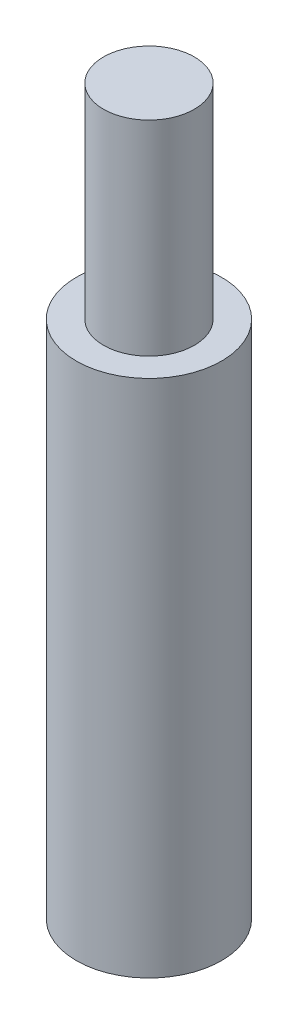
ISO-10303-21;
HEADER;
FILE_DESCRIPTION(('STEP AP214'),'2;1');
FILE_NAME('part.step','',(''),(''),'','','');
FILE_SCHEMA(('AUTOMOTIVE_DESIGN { 1 0 10303 214 1 1 1 1 }'));
ENDSEC;
DATA;
#1=APPLICATION_CONTEXT('core data for automotive mechanical design processes');
#2=APPLICATION_PROTOCOL_DEFINITION('international standard','automotive_design',2000,#1);
#3=PRODUCT_CONTEXT('',#1,'mechanical');
#4=PRODUCT('Part','Part','',(#3));
#5=PRODUCT_RELATED_PRODUCT_CATEGORY('part','',(#4));
#6=PRODUCT_DEFINITION_FORMATION('','',#4);
#7=PRODUCT_DEFINITION_CONTEXT('part definition',#1,'design');
#8=PRODUCT_DEFINITION('design','',#6,#7);
#9=PRODUCT_DEFINITION_SHAPE('','',#8);
#10=(LENGTH_UNIT() NAMED_UNIT(*) SI_UNIT(.MILLI.,.METRE.));
#11=(NAMED_UNIT(*) PLANE_ANGLE_UNIT() SI_UNIT($,.RADIAN.));
#12=(NAMED_UNIT(*) SI_UNIT($,.STERADIAN.) SOLID_ANGLE_UNIT());
#13=UNCERTAINTY_MEASURE_WITH_UNIT(LENGTH_MEASURE(1.E-05),#10,'distance_accuracy_value','');
#14=(GEOMETRIC_REPRESENTATION_CONTEXT(3) GLOBAL_UNCERTAINTY_ASSIGNED_CONTEXT((#13)) GLOBAL_UNIT_ASSIGNED_CONTEXT((#10,
#11,#12)) REPRESENTATION_CONTEXT('',''));
#15=CARTESIAN_POINT('',(0.,0.,0.));
#16=DIRECTION('',(0.,0.,1.));
#17=DIRECTION('',(1.,0.,0.));
#18=AXIS2_PLACEMENT_3D('',#15,#16,#17);
#19=CARTESIAN_POINT('',(0.,50.620000106,0.));
#20=DIRECTION('',(0.,-1.,0.));
#21=DIRECTION('',(0.,0.,-1.));
#22=AXIS2_PLACEMENT_3D('',#19,#20,#21);
#23=CYLINDRICAL_SURFACE('',#22,5.08);
#24=CARTESIAN_POINT('',(0.,0.,0.));
#25=DIRECTION('',(0.,1.,0.));
#26=DIRECTION('',(0.,0.,1.));
#27=AXIS2_PLACEMENT_3D('',#24,#25,#26);
#28=CIRCLE('',#27,5.08);
#29=CARTESIAN_POINT('',(0.,0.,5.08));
#30=VERTEX_POINT('',#29);
#31=EDGE_CURVE('E10',#30,#30,#28,.T.);
#32=ORIENTED_EDGE('',*,*,#31,.T.);
#33=EDGE_LOOP('',(#32));
#34=FACE_BOUND('',#33,.T.);
#35=CARTESIAN_POINT('',(0.,36.320000106,0.));
#36=DIRECTION('',(0.,1.,0.));
#37=DIRECTION('',(0.,0.,1.));
#38=AXIS2_PLACEMENT_3D('',#35,#36,#37);
#39=CIRCLE('',#38,5.08);
#40=CARTESIAN_POINT('',(0.,36.320000106,5.08));
#41=VERTEX_POINT('',#40);
#42=EDGE_CURVE('E37',#41,#41,#39,.T.);
#43=ORIENTED_EDGE('',*,*,#42,.F.);
#44=EDGE_LOOP('',(#43));
#45=FACE_BOUND('',#44,.T.);
#46=ADVANCED_FACE('F31',(#34,#45),#23,.T.);
#47=CARTESIAN_POINT('',(0.,0.,0.));
#48=DIRECTION('',(0.,1.,0.));
#49=DIRECTION('',(0.,0.,1.));
#50=AXIS2_PLACEMENT_3D('',#47,#48,#49);
#51=PLANE('',#50);
#52=ORIENTED_EDGE('',*,*,#31,.F.);
#53=EDGE_LOOP('',(#52));
#54=FACE_BOUND('',#53,.T.);
#55=ADVANCED_FACE('F63',(#54),#51,.F.);
#56=CARTESIAN_POINT('',(0.,36.320000106,0.));
#57=DIRECTION('',(0.,1.,0.));
#58=DIRECTION('',(0.,0.,1.));
#59=AXIS2_PLACEMENT_3D('',#56,#57,#58);
#60=PLANE('',#59);
#61=CARTESIAN_POINT('',(0.,36.320000106,0.));
#62=DIRECTION('',(0.,1.,0.));
#63=DIRECTION('',(0.,0.,1.));
#64=AXIS2_PLACEMENT_3D('',#61,#62,#63);
#65=CIRCLE('',#64,3.175);
#66=CARTESIAN_POINT('',(0.,36.320000106,3.175));
#67=VERTEX_POINT('',#66);
#68=EDGE_CURVE('E41',#67,#67,#65,.T.);
#69=ORIENTED_EDGE('',*,*,#68,.F.);
#70=EDGE_LOOP('',(#69));
#71=FACE_BOUND('',#70,.T.);
#72=ORIENTED_EDGE('',*,*,#42,.T.);
#73=EDGE_LOOP('',(#72));
#74=FACE_BOUND('',#73,.T.);
#75=ADVANCED_FACE('F55',(#71,#74),#60,.T.);
#76=CARTESIAN_POINT('',(0.,36.320000106,0.));
#77=DIRECTION('',(0.,1.,0.));
#78=DIRECTION('',(0.,0.,1.));
#79=AXIS2_PLACEMENT_3D('',#76,#77,#78);
#80=CYLINDRICAL_SURFACE('',#79,3.175);
#81=ORIENTED_EDGE('',*,*,#68,.T.);
#82=EDGE_LOOP('',(#81));
#83=FACE_BOUND('',#82,.T.);
#84=CARTESIAN_POINT('',(0.,50.620000106,0.));
#85=DIRECTION('',(0.,1.,0.));
#86=DIRECTION('',(0.,0.,1.));
#87=AXIS2_PLACEMENT_3D('',#84,#85,#86);
#88=CIRCLE('',#87,3.175);
#89=CARTESIAN_POINT('',(0.,50.620000106,3.175));
#90=VERTEX_POINT('',#89);
#91=EDGE_CURVE('E45',#90,#90,#88,.T.);
#92=ORIENTED_EDGE('',*,*,#91,.F.);
#93=EDGE_LOOP('',(#92));
#94=FACE_BOUND('',#93,.T.);
#95=ADVANCED_FACE('F53',(#83,#94),#80,.T.);
#96=CARTESIAN_POINT('',(0.,50.620000106,0.));
#97=DIRECTION('',(0.,1.,0.));
#98=DIRECTION('',(0.,0.,1.));
#99=AXIS2_PLACEMENT_3D('',#96,#97,#98);
#100=PLANE('',#99);
#101=ORIENTED_EDGE('',*,*,#91,.T.);
#102=EDGE_LOOP('',(#101));
#103=FACE_BOUND('',#102,.T.);
#104=ADVANCED_FACE('F51',(#103),#100,.T.);
#105=CLOSED_SHELL('',(#46,#55,#75,#95,#104));
#106=MANIFOLD_SOLID_BREP('B2',#105);
#107=ADVANCED_BREP_SHAPE_REPRESENTATION('',(#18,#106),#14);
#108=SHAPE_DEFINITION_REPRESENTATION(#9,#107);
ENDSEC;
END-ISO-10303-21;
